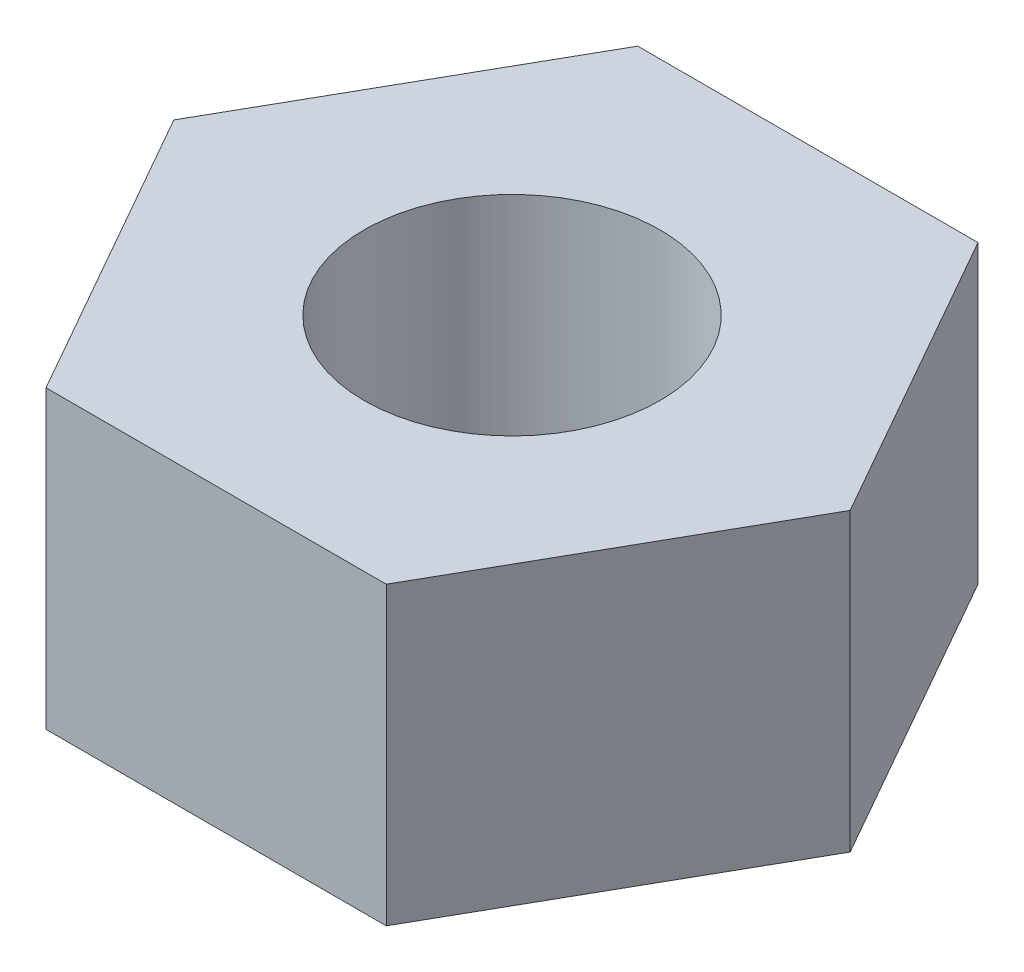
ISO-10303-21;
HEADER;
FILE_DESCRIPTION(('STEP AP214'),'2;1');
FILE_NAME('part.step','',(''),(''),'','','');
FILE_SCHEMA(('AUTOMOTIVE_DESIGN { 1 0 10303 214 1 1 1 1 }'));
ENDSEC;
DATA;
#1=APPLICATION_CONTEXT('core data for automotive mechanical design processes');
#2=APPLICATION_PROTOCOL_DEFINITION('international standard','automotive_design',2000,#1);
#3=PRODUCT_CONTEXT('',#1,'mechanical');
#4=PRODUCT('Part','Part','',(#3));
#5=PRODUCT_RELATED_PRODUCT_CATEGORY('part','',(#4));
#6=PRODUCT_DEFINITION_FORMATION('','',#4);
#7=PRODUCT_DEFINITION_CONTEXT('part definition',#1,'design');
#8=PRODUCT_DEFINITION('design','',#6,#7);
#9=PRODUCT_DEFINITION_SHAPE('','',#8);
#10=(LENGTH_UNIT() NAMED_UNIT(*) SI_UNIT(.MILLI.,.METRE.));
#11=(NAMED_UNIT(*) PLANE_ANGLE_UNIT() SI_UNIT($,.RADIAN.));
#12=(NAMED_UNIT(*) SI_UNIT($,.STERADIAN.) SOLID_ANGLE_UNIT());
#13=UNCERTAINTY_MEASURE_WITH_UNIT(LENGTH_MEASURE(1.E-05),#10,'distance_accuracy_value','');
#14=(GEOMETRIC_REPRESENTATION_CONTEXT(3) GLOBAL_UNCERTAINTY_ASSIGNED_CONTEXT((#13)) GLOBAL_UNIT_ASSIGNED_CONTEXT((#10,
#11,#12)) REPRESENTATION_CONTEXT('',''));
#15=CARTESIAN_POINT('',(0.,0.,0.));
#16=DIRECTION('',(0.,0.,1.));
#17=DIRECTION('',(1.,0.,0.));
#18=AXIS2_PLACEMENT_3D('',#15,#16,#17);
#19=CARTESIAN_POINT('',(0.,10.,0.));
#20=DIRECTION('',(0.,-1.,0.));
#21=DIRECTION('',(0.,0.,-1.));
#22=AXIS2_PLACEMENT_3D('',#19,#20,#21);
#23=PLANE('',#22);
#24=DIRECTION('',(-0.493818117026111,0.,0.869565217391305));
#25=VECTOR('',#24,1.);
#26=CARTESIAN_POINT('',(-11.43,10.,0.));
#27=LINE('',#26,#25);
#28=CARTESIAN_POINT('',(-5.75109165419973,10.,-9.99999999999999));
#29=VERTEX_POINT('',#28);
#30=CARTESIAN_POINT('',(-11.43,10.,0.));
#31=VERTEX_POINT('',#30);
#32=EDGE_CURVE('E150',#29,#31,#27,.T.);
#33=ORIENTED_EDGE('',*,*,#32,.T.);
#34=DIRECTION('',(0.49381811702611,0.,0.869565217391304));
#35=VECTOR('',#34,1.);
#36=CARTESIAN_POINT('',(-5.75109165419973,10.,10.));
#37=LINE('',#36,#35);
#38=CARTESIAN_POINT('',(-5.75109165419973,10.,10.));
#39=VERTEX_POINT('',#38);
#40=EDGE_CURVE('E98',#31,#39,#37,.T.);
#41=ORIENTED_EDGE('',*,*,#40,.T.);
#42=DIRECTION('',(1.,0.,0.));
#43=VECTOR('',#42,1.);
#44=CARTESIAN_POINT('',(5.74890834580027,10.,10.));
#45=LINE('',#44,#43);
#46=CARTESIAN_POINT('',(5.74890834580027,10.,10.));
#47=VERTEX_POINT('',#46);
#48=EDGE_CURVE('E111',#39,#47,#45,.T.);
#49=ORIENTED_EDGE('',*,*,#48,.T.);
#50=DIRECTION('',(0.49381811702611,0.,-0.869565217391305));
#51=VECTOR('',#50,1.);
#52=CARTESIAN_POINT('',(11.4278166916005,10.,0.));
#53=LINE('',#52,#51);
#54=CARTESIAN_POINT('',(11.4278166916005,10.,0.));
#55=VERTEX_POINT('',#54);
#56=EDGE_CURVE('E105',#47,#55,#53,.T.);
#57=ORIENTED_EDGE('',*,*,#56,.T.);
#58=DIRECTION('',(-0.493818117026111,0.,-0.869565217391304));
#59=VECTOR('',#58,1.);
#60=CARTESIAN_POINT('',(5.74890834580027,10.,-9.99999999999999));
#61=LINE('',#60,#59);
#62=CARTESIAN_POINT('',(5.74890834580027,10.,-9.99999999999999));
#63=VERTEX_POINT('',#62);
#64=EDGE_CURVE('E109',#55,#63,#61,.T.);
#65=ORIENTED_EDGE('',*,*,#64,.T.);
#66=DIRECTION('',(-1.,0.,0.));
#67=VECTOR('',#66,1.);
#68=CARTESIAN_POINT('',(-5.75109165419973,10.,-9.99999999999999));
#69=LINE('',#68,#67);
#70=EDGE_CURVE('E61',#63,#29,#69,.T.);
#71=ORIENTED_EDGE('',*,*,#70,.T.);
#72=EDGE_LOOP('',(#33,#41,#49,#57,#65,#71));
#73=FACE_BOUND('',#72,.T.);
#74=CARTESIAN_POINT('',(0.,10.,0.));
#75=DIRECTION('',(0.,1.,0.));
#76=DIRECTION('',(0.,0.,1.));
#77=AXIS2_PLACEMENT_3D('',#74,#75,#76);
#78=CIRCLE('',#77,5.);
#79=CARTESIAN_POINT('',(0.,10.,5.));
#80=VERTEX_POINT('',#79);
#81=EDGE_CURVE('E138',#80,#80,#78,.T.);
#82=ORIENTED_EDGE('',*,*,#81,.F.);
#83=EDGE_LOOP('',(#82));
#84=FACE_BOUND('',#83,.T.);
#85=ADVANCED_FACE('F43',(#73,#84),#23,.F.);
#86=CARTESIAN_POINT('',(0.,0.,0.));
#87=DIRECTION('',(0.,-1.,0.));
#88=DIRECTION('',(0.,0.,-1.));
#89=AXIS2_PLACEMENT_3D('',#86,#87,#88);
#90=PLANE('',#89);
#91=DIRECTION('',(-0.493818117026111,0.,0.869565217391305));
#92=VECTOR('',#91,1.);
#93=CARTESIAN_POINT('',(-11.43,0.,0.));
#94=LINE('',#93,#92);
#95=CARTESIAN_POINT('',(-5.75109165419973,0.,-9.99999999999999));
#96=VERTEX_POINT('',#95);
#97=CARTESIAN_POINT('',(-11.43,0.,0.));
#98=VERTEX_POINT('',#97);
#99=EDGE_CURVE('E133',#96,#98,#94,.T.);
#100=ORIENTED_EDGE('',*,*,#99,.F.);
#101=DIRECTION('',(-1.,0.,0.));
#102=VECTOR('',#101,1.);
#103=CARTESIAN_POINT('',(-5.75109165419973,0.,-9.99999999999999));
#104=LINE('',#103,#102);
#105=CARTESIAN_POINT('',(5.74890834580027,0.,-9.99999999999999));
#106=VERTEX_POINT('',#105);
#107=EDGE_CURVE('E90',#106,#96,#104,.T.);
#108=ORIENTED_EDGE('',*,*,#107,.F.);
#109=DIRECTION('',(-0.493818117026111,0.,-0.869565217391304));
#110=VECTOR('',#109,1.);
#111=CARTESIAN_POINT('',(5.74890834580027,0.,-9.99999999999999));
#112=LINE('',#111,#110);
#113=CARTESIAN_POINT('',(11.4278166916005,0.,0.));
#114=VERTEX_POINT('',#113);
#115=EDGE_CURVE('E84',#114,#106,#112,.T.);
#116=ORIENTED_EDGE('',*,*,#115,.F.);
#117=DIRECTION('',(0.49381811702611,0.,-0.869565217391305));
#118=VECTOR('',#117,1.);
#119=CARTESIAN_POINT('',(11.4278166916005,0.,0.));
#120=LINE('',#119,#118);
#121=CARTESIAN_POINT('',(5.74890834580027,0.,10.));
#122=VERTEX_POINT('',#121);
#123=EDGE_CURVE('E120',#122,#114,#120,.T.);
#124=ORIENTED_EDGE('',*,*,#123,.F.);
#125=DIRECTION('',(1.,0.,0.));
#126=VECTOR('',#125,1.);
#127=CARTESIAN_POINT('',(5.74890834580027,0.,10.));
#128=LINE('',#127,#126);
#129=CARTESIAN_POINT('',(-5.75109165419973,0.,10.));
#130=VERTEX_POINT('',#129);
#131=EDGE_CURVE('E141',#130,#122,#128,.T.);
#132=ORIENTED_EDGE('',*,*,#131,.F.);
#133=DIRECTION('',(0.49381811702611,0.,0.869565217391304));
#134=VECTOR('',#133,1.);
#135=CARTESIAN_POINT('',(-5.75109165419973,0.,10.));
#136=LINE('',#135,#134);
#137=EDGE_CURVE('E137',#98,#130,#136,.T.);
#138=ORIENTED_EDGE('',*,*,#137,.F.);
#139=EDGE_LOOP('',(#100,#108,#116,#124,#132,#138));
#140=FACE_BOUND('',#139,.T.);
#141=CARTESIAN_POINT('',(0.,0.,0.));
#142=DIRECTION('',(0.,1.,0.));
#143=DIRECTION('',(0.,0.,1.));
#144=AXIS2_PLACEMENT_3D('',#141,#142,#143);
#145=CIRCLE('',#144,5.);
#146=CARTESIAN_POINT('',(0.,0.,5.));
#147=VERTEX_POINT('',#146);
#148=EDGE_CURVE('E265',#147,#147,#145,.T.);
#149=ORIENTED_EDGE('',*,*,#148,.T.);
#150=EDGE_LOOP('',(#149));
#151=FACE_BOUND('',#150,.T.);
#152=ADVANCED_FACE('F163',(#140,#151),#90,.T.);
#153=CARTESIAN_POINT('',(-11.43,10.,0.));
#154=DIRECTION('',(0.869565217391305,0.,0.493818117026111));
#155=DIRECTION('',(0.493818117026111,0.,-0.869565217391305));
#156=AXIS2_PLACEMENT_3D('',#153,#154,#155);
#157=PLANE('',#156);
#158=ORIENTED_EDGE('',*,*,#99,.T.);
#159=DIRECTION('',(0.,-1.,0.));
#160=VECTOR('',#159,1.);
#161=CARTESIAN_POINT('',(-11.43,10.,0.));
#162=LINE('',#161,#160);
#163=EDGE_CURVE('E11',#31,#98,#162,.T.);
#164=ORIENTED_EDGE('',*,*,#163,.F.);
#165=ORIENTED_EDGE('',*,*,#32,.F.);
#166=DIRECTION('',(0.,-1.,0.));
#167=VECTOR('',#166,1.);
#168=CARTESIAN_POINT('',(-5.75109165419973,10.,-9.99999999999999));
#169=LINE('',#168,#167);
#170=EDGE_CURVE('E129',#29,#96,#169,.T.);
#171=ORIENTED_EDGE('',*,*,#170,.T.);
#172=EDGE_LOOP('',(#158,#164,#165,#171));
#173=FACE_BOUND('',#172,.T.);
#174=ADVANCED_FACE('F45',(#173),#157,.F.);
#175=CARTESIAN_POINT('',(-5.75109165419973,10.,10.));
#176=DIRECTION('',(0.869565217391305,0.,-0.49381811702611));
#177=DIRECTION('',(-0.49381811702611,0.,-0.869565217391305));
#178=AXIS2_PLACEMENT_3D('',#175,#176,#177);
#179=PLANE('',#178);
#180=ORIENTED_EDGE('',*,*,#137,.T.);
#181=DIRECTION('',(0.,-1.,0.));
#182=VECTOR('',#181,1.);
#183=CARTESIAN_POINT('',(-5.75109165419973,10.,10.));
#184=LINE('',#183,#182);
#185=EDGE_CURVE('E53',#39,#130,#184,.T.);
#186=ORIENTED_EDGE('',*,*,#185,.F.);
#187=ORIENTED_EDGE('',*,*,#40,.F.);
#188=ORIENTED_EDGE('',*,*,#163,.T.);
#189=EDGE_LOOP('',(#180,#186,#187,#188));
#190=FACE_BOUND('',#189,.T.);
#191=ADVANCED_FACE('F188',(#190),#179,.F.);
#192=CARTESIAN_POINT('',(5.74890834580027,10.,10.));
#193=DIRECTION('',(0.,0.,-1.));
#194=DIRECTION('',(-1.,0.,0.));
#195=AXIS2_PLACEMENT_3D('',#192,#193,#194);
#196=PLANE('',#195);
#197=ORIENTED_EDGE('',*,*,#131,.T.);
#198=DIRECTION('',(0.,-1.,0.));
#199=VECTOR('',#198,1.);
#200=CARTESIAN_POINT('',(5.74890834580027,10.,10.));
#201=LINE('',#200,#199);
#202=EDGE_CURVE('E122',#47,#122,#201,.T.);
#203=ORIENTED_EDGE('',*,*,#202,.F.);
#204=ORIENTED_EDGE('',*,*,#48,.F.);
#205=ORIENTED_EDGE('',*,*,#185,.T.);
#206=EDGE_LOOP('',(#197,#203,#204,#205));
#207=FACE_BOUND('',#206,.T.);
#208=ADVANCED_FACE('F160',(#207),#196,.F.);
#209=CARTESIAN_POINT('',(11.4278166916005,10.,0.));
#210=DIRECTION('',(-0.869565217391305,0.,-0.49381811702611));
#211=DIRECTION('',(-0.49381811702611,0.,0.869565217391305));
#212=AXIS2_PLACEMENT_3D('',#209,#210,#211);
#213=PLANE('',#212);
#214=ORIENTED_EDGE('',*,*,#123,.T.);
#215=DIRECTION('',(0.,-1.,0.));
#216=VECTOR('',#215,1.);
#217=CARTESIAN_POINT('',(11.4278166916005,10.,0.));
#218=LINE('',#217,#216);
#219=EDGE_CURVE('E117',#55,#114,#218,.T.);
#220=ORIENTED_EDGE('',*,*,#219,.F.);
#221=ORIENTED_EDGE('',*,*,#56,.F.);
#222=ORIENTED_EDGE('',*,*,#202,.T.);
#223=EDGE_LOOP('',(#214,#220,#221,#222));
#224=FACE_BOUND('',#223,.T.);
#225=ADVANCED_FACE('F118',(#224),#213,.F.);
#226=CARTESIAN_POINT('',(5.74890834580027,10.,-9.99999999999999));
#227=DIRECTION('',(-0.869565217391305,0.,0.493818117026111));
#228=DIRECTION('',(0.493818117026111,0.,0.869565217391305));
#229=AXIS2_PLACEMENT_3D('',#226,#227,#228);
#230=PLANE('',#229);
#231=ORIENTED_EDGE('',*,*,#115,.T.);
#232=DIRECTION('',(0.,-1.,0.));
#233=VECTOR('',#232,1.);
#234=CARTESIAN_POINT('',(5.74890834580027,10.,-9.99999999999999));
#235=LINE('',#234,#233);
#236=EDGE_CURVE('E123',#63,#106,#235,.T.);
#237=ORIENTED_EDGE('',*,*,#236,.F.);
#238=ORIENTED_EDGE('',*,*,#64,.F.);
#239=ORIENTED_EDGE('',*,*,#219,.T.);
#240=EDGE_LOOP('',(#231,#237,#238,#239));
#241=FACE_BOUND('',#240,.T.);
#242=ADVANCED_FACE('F125',(#241),#230,.F.);
#243=CARTESIAN_POINT('',(-5.75109165419973,10.,-9.99999999999999));
#244=DIRECTION('',(0.,0.,1.));
#245=DIRECTION('',(1.,0.,0.));
#246=AXIS2_PLACEMENT_3D('',#243,#244,#245);
#247=PLANE('',#246);
#248=ORIENTED_EDGE('',*,*,#107,.T.);
#249=ORIENTED_EDGE('',*,*,#170,.F.);
#250=ORIENTED_EDGE('',*,*,#70,.F.);
#251=ORIENTED_EDGE('',*,*,#236,.T.);
#252=EDGE_LOOP('',(#248,#249,#250,#251));
#253=FACE_BOUND('',#252,.T.);
#254=ADVANCED_FACE('F168',(#253),#247,.F.);
#255=CARTESIAN_POINT('',(0.,10.,0.));
#256=DIRECTION('',(0.,-1.,0.));
#257=DIRECTION('',(0.,0.,-1.));
#258=AXIS2_PLACEMENT_3D('',#255,#256,#257);
#259=CYLINDRICAL_SURFACE('',#258,5.);
#260=ORIENTED_EDGE('',*,*,#81,.T.);
#261=EDGE_LOOP('',(#260));
#262=FACE_BOUND('',#261,.T.);
#263=ORIENTED_EDGE('',*,*,#148,.F.);
#264=EDGE_LOOP('',(#263));
#265=FACE_BOUND('',#264,.T.);
#266=ADVANCED_FACE('F170',(#262,#265),#259,.F.);
#267=CLOSED_SHELL('',(#85,#152,#174,#191,#208,#225,#242,#254,#266));
#268=MANIFOLD_SOLID_BREP('B2',#267);
#269=ADVANCED_BREP_SHAPE_REPRESENTATION('',(#18,#268),#14);
#270=SHAPE_DEFINITION_REPRESENTATION(#9,#269);
ENDSEC;
END-ISO-10303-21;
